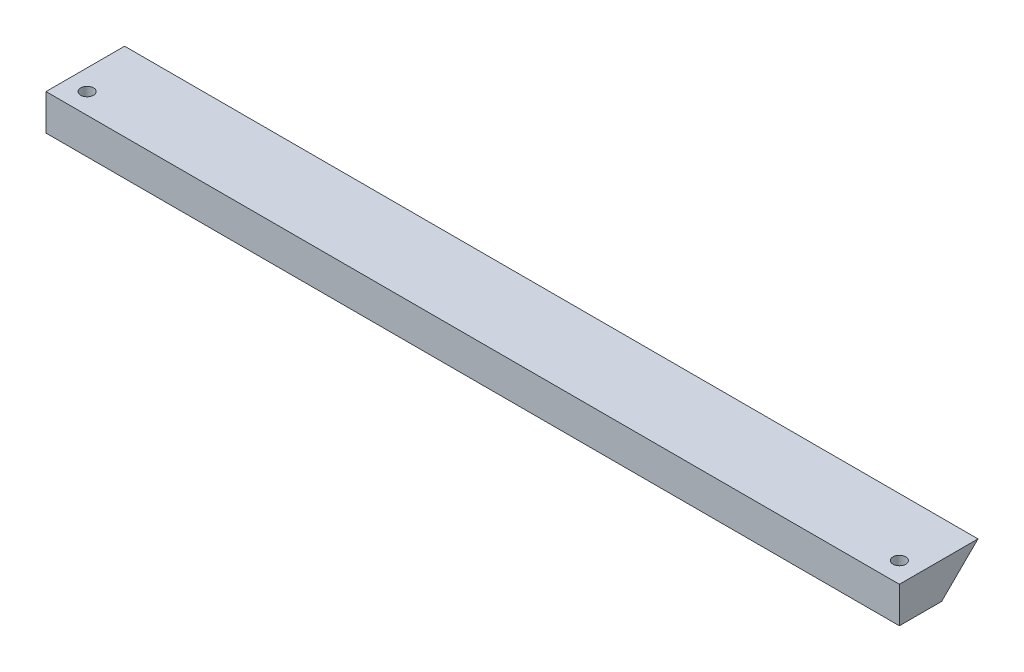
ISO-10303-21;
HEADER;
FILE_DESCRIPTION(('STEP AP214'),'2;1');
FILE_NAME('part.step','',(''),(''),'','','');
FILE_SCHEMA(('AUTOMOTIVE_DESIGN { 1 0 10303 214 1 1 1 1 }'));
ENDSEC;
DATA;
#1=APPLICATION_CONTEXT('core data for automotive mechanical design processes');
#2=APPLICATION_PROTOCOL_DEFINITION('international standard','automotive_design',2000,#1);
#3=PRODUCT_CONTEXT('',#1,'mechanical');
#4=PRODUCT('Part','Part','',(#3));
#5=PRODUCT_RELATED_PRODUCT_CATEGORY('part','',(#4));
#6=PRODUCT_DEFINITION_FORMATION('','',#4);
#7=PRODUCT_DEFINITION_CONTEXT('part definition',#1,'design');
#8=PRODUCT_DEFINITION('design','',#6,#7);
#9=PRODUCT_DEFINITION_SHAPE('','',#8);
#10=(LENGTH_UNIT() NAMED_UNIT(*) SI_UNIT(.MILLI.,.METRE.));
#11=(NAMED_UNIT(*) PLANE_ANGLE_UNIT() SI_UNIT($,.RADIAN.));
#12=(NAMED_UNIT(*) SI_UNIT($,.STERADIAN.) SOLID_ANGLE_UNIT());
#13=UNCERTAINTY_MEASURE_WITH_UNIT(LENGTH_MEASURE(1.E-05),#10,'distance_accuracy_value','');
#14=(GEOMETRIC_REPRESENTATION_CONTEXT(3) GLOBAL_UNCERTAINTY_ASSIGNED_CONTEXT((#13)) GLOBAL_UNIT_ASSIGNED_CONTEXT((#10,
#11,#12)) REPRESENTATION_CONTEXT('',''));
#15=CARTESIAN_POINT('',(0.,0.,0.));
#16=DIRECTION('',(0.,0.,1.));
#17=DIRECTION('',(1.,0.,0.));
#18=AXIS2_PLACEMENT_3D('',#15,#16,#17);
#19=CARTESIAN_POINT('',(83.,-7.,0.));
#20=DIRECTION('',(0.,0.,-1.));
#21=DIRECTION('',(-1.,0.,0.));
#22=AXIS2_PLACEMENT_3D('',#19,#20,#21);
#23=PLANE('',#22);
#24=DIRECTION('',(0.,-1.,0.));
#25=VECTOR('',#24,1.);
#26=CARTESIAN_POINT('',(-83.,-7.,0.));
#27=LINE('',#26,#25);
#28=CARTESIAN_POINT('',(-83.,0.,0.));
#29=VERTEX_POINT('',#28);
#30=CARTESIAN_POINT('',(-83.,-7.,0.));
#31=VERTEX_POINT('',#30);
#32=EDGE_CURVE('E98',#29,#31,#27,.T.);
#33=ORIENTED_EDGE('',*,*,#32,.T.);
#34=DIRECTION('',(-1.,0.,0.));
#35=VECTOR('',#34,1.);
#36=CARTESIAN_POINT('',(83.,-7.,0.));
#37=LINE('',#36,#35);
#38=CARTESIAN_POINT('',(83.,-7.,0.));
#39=VERTEX_POINT('',#38);
#40=EDGE_CURVE('E11',#39,#31,#37,.T.);
#41=ORIENTED_EDGE('',*,*,#40,.F.);
#42=DIRECTION('',(0.,-1.,0.));
#43=VECTOR('',#42,1.);
#44=CARTESIAN_POINT('',(83.,-7.,0.));
#45=LINE('',#44,#43);
#46=CARTESIAN_POINT('',(83.,0.,0.));
#47=VERTEX_POINT('',#46);
#48=EDGE_CURVE('E86',#47,#39,#45,.T.);
#49=ORIENTED_EDGE('',*,*,#48,.F.);
#50=DIRECTION('',(-1.,0.,0.));
#51=VECTOR('',#50,1.);
#52=CARTESIAN_POINT('',(83.,0.,0.));
#53=LINE('',#52,#51);
#54=EDGE_CURVE('E94',#47,#29,#53,.T.);
#55=ORIENTED_EDGE('',*,*,#54,.T.);
#56=EDGE_LOOP('',(#33,#41,#49,#55));
#57=FACE_BOUND('',#56,.T.);
#58=ADVANCED_FACE('F35',(#57),#23,.F.);
#59=CARTESIAN_POINT('',(83.,-7.,-8.22));
#60=DIRECTION('',(0.,1.,0.));
#61=DIRECTION('',(0.,0.,1.));
#62=AXIS2_PLACEMENT_3D('',#59,#60,#61);
#63=PLANE('',#62);
#64=CARTESIAN_POINT('',(-79.,-7.,-4.));
#65=DIRECTION('',(0.,-1.,0.));
#66=DIRECTION('',(0.,0.,-1.));
#67=AXIS2_PLACEMENT_3D('',#64,#65,#66);
#68=CIRCLE('',#67,1.24999999999999);
#69=CARTESIAN_POINT('',(-79.,-7.,-5.24999999999999));
#70=VERTEX_POINT('',#69);
#71=EDGE_CURVE('E120',#70,#70,#68,.T.);
#72=ORIENTED_EDGE('',*,*,#71,.F.);
#73=EDGE_LOOP('',(#72));
#74=FACE_BOUND('',#73,.T.);
#75=CARTESIAN_POINT('',(79.,-7.,-4.));
#76=DIRECTION('',(0.,-1.,0.));
#77=DIRECTION('',(0.,0.,-1.));
#78=AXIS2_PLACEMENT_3D('',#75,#76,#77);
#79=CIRCLE('',#78,1.24999999999999);
#80=CARTESIAN_POINT('',(79.,-7.,-5.24999999999999));
#81=VERTEX_POINT('',#80);
#82=EDGE_CURVE('E114',#81,#81,#79,.T.);
#83=ORIENTED_EDGE('',*,*,#82,.F.);
#84=EDGE_LOOP('',(#83));
#85=FACE_BOUND('',#84,.T.);
#86=DIRECTION('',(0.,0.,-1.));
#87=VECTOR('',#86,1.);
#88=CARTESIAN_POINT('',(-83.,-7.,-8.22));
#89=LINE('',#88,#87);
#90=CARTESIAN_POINT('',(-83.,-7.,-8.22));
#91=VERTEX_POINT('',#90);
#92=EDGE_CURVE('E90',#31,#91,#89,.T.);
#93=ORIENTED_EDGE('',*,*,#92,.T.);
#94=DIRECTION('',(-1.,0.,0.));
#95=VECTOR('',#94,1.);
#96=CARTESIAN_POINT('',(83.,-7.,-8.22));
#97=LINE('',#96,#95);
#98=CARTESIAN_POINT('',(83.,-7.,-8.22));
#99=VERTEX_POINT('',#98);
#100=EDGE_CURVE('E43',#99,#91,#97,.T.);
#101=ORIENTED_EDGE('',*,*,#100,.F.);
#102=DIRECTION('',(0.,0.,-1.));
#103=VECTOR('',#102,1.);
#104=CARTESIAN_POINT('',(83.,-7.,-8.22));
#105=LINE('',#104,#103);
#106=EDGE_CURVE('E81',#39,#99,#105,.T.);
#107=ORIENTED_EDGE('',*,*,#106,.F.);
#108=ORIENTED_EDGE('',*,*,#40,.T.);
#109=EDGE_LOOP('',(#93,#101,#107,#108));
#110=FACE_BOUND('',#109,.T.);
#111=ADVANCED_FACE('F89',(#74,#85,#110),#63,.F.);
#112=CARTESIAN_POINT('',(83.,0.,-15.29));
#113=DIRECTION('',(0.,0.710615930892041,0.703580129596081));
#114=DIRECTION('',(0.,-0.703580129596081,0.710615930892041));
#115=AXIS2_PLACEMENT_3D('',#112,#113,#114);
#116=PLANE('',#115);
#117=DIRECTION('',(0.,0.703580129596081,-0.710615930892041));
#118=VECTOR('',#117,1.);
#119=CARTESIAN_POINT('',(-83.,0.,-15.29));
#120=LINE('',#119,#118);
#121=CARTESIAN_POINT('',(-83.,0.,-15.29));
#122=VERTEX_POINT('',#121);
#123=EDGE_CURVE('E68',#91,#122,#120,.T.);
#124=ORIENTED_EDGE('',*,*,#123,.T.);
#125=DIRECTION('',(-1.,0.,0.));
#126=VECTOR('',#125,1.);
#127=CARTESIAN_POINT('',(83.,0.,-15.29));
#128=LINE('',#127,#126);
#129=CARTESIAN_POINT('',(83.,0.,-15.29));
#130=VERTEX_POINT('',#129);
#131=EDGE_CURVE('E91',#130,#122,#128,.T.);
#132=ORIENTED_EDGE('',*,*,#131,.F.);
#133=DIRECTION('',(0.,0.703580129596081,-0.710615930892041));
#134=VECTOR('',#133,1.);
#135=CARTESIAN_POINT('',(83.,0.,-15.29));
#136=LINE('',#135,#134);
#137=EDGE_CURVE('E84',#99,#130,#136,.T.);
#138=ORIENTED_EDGE('',*,*,#137,.F.);
#139=ORIENTED_EDGE('',*,*,#100,.T.);
#140=EDGE_LOOP('',(#124,#132,#138,#139));
#141=FACE_BOUND('',#140,.T.);
#142=ADVANCED_FACE('F92',(#141),#116,.F.);
#143=CARTESIAN_POINT('',(83.,0.,0.));
#144=DIRECTION('',(0.,-1.,0.));
#145=DIRECTION('',(0.,0.,-1.));
#146=AXIS2_PLACEMENT_3D('',#143,#144,#145);
#147=PLANE('',#146);
#148=CARTESIAN_POINT('',(-79.,0.,-4.));
#149=DIRECTION('',(0.,-1.,0.));
#150=DIRECTION('',(0.,0.,-1.));
#151=AXIS2_PLACEMENT_3D('',#148,#149,#150);
#152=CIRCLE('',#151,1.25);
#153=CARTESIAN_POINT('',(-79.,0.,-5.25));
#154=VERTEX_POINT('',#153);
#155=EDGE_CURVE('E117',#154,#154,#152,.T.);
#156=ORIENTED_EDGE('',*,*,#155,.T.);
#157=EDGE_LOOP('',(#156));
#158=FACE_BOUND('',#157,.T.);
#159=CARTESIAN_POINT('',(79.,0.,-4.));
#160=DIRECTION('',(0.,-1.,0.));
#161=DIRECTION('',(0.,0.,-1.));
#162=AXIS2_PLACEMENT_3D('',#159,#160,#161);
#163=CIRCLE('',#162,1.25);
#164=CARTESIAN_POINT('',(79.,0.,-5.25));
#165=VERTEX_POINT('',#164);
#166=EDGE_CURVE('E101',#165,#165,#163,.T.);
#167=ORIENTED_EDGE('',*,*,#166,.T.);
#168=EDGE_LOOP('',(#167));
#169=FACE_BOUND('',#168,.T.);
#170=DIRECTION('',(0.,0.,1.));
#171=VECTOR('',#170,1.);
#172=CARTESIAN_POINT('',(-83.,0.,0.));
#173=LINE('',#172,#171);
#174=EDGE_CURVE('E74',#122,#29,#173,.T.);
#175=ORIENTED_EDGE('',*,*,#174,.T.);
#176=ORIENTED_EDGE('',*,*,#54,.F.);
#177=DIRECTION('',(0.,0.,1.));
#178=VECTOR('',#177,1.);
#179=CARTESIAN_POINT('',(83.,0.,0.));
#180=LINE('',#179,#178);
#181=EDGE_CURVE('E51',#130,#47,#180,.T.);
#182=ORIENTED_EDGE('',*,*,#181,.F.);
#183=ORIENTED_EDGE('',*,*,#131,.T.);
#184=EDGE_LOOP('',(#175,#176,#182,#183));
#185=FACE_BOUND('',#184,.T.);
#186=ADVANCED_FACE('F106',(#158,#169,#185),#147,.F.);
#187=CARTESIAN_POINT('',(83.,0.,0.));
#188=DIRECTION('',(-1.,0.,0.));
#189=DIRECTION('',(0.,0.,1.));
#190=AXIS2_PLACEMENT_3D('',#187,#188,#189);
#191=PLANE('',#190);
#192=ORIENTED_EDGE('',*,*,#48,.T.);
#193=ORIENTED_EDGE('',*,*,#106,.T.);
#194=ORIENTED_EDGE('',*,*,#137,.T.);
#195=ORIENTED_EDGE('',*,*,#181,.T.);
#196=EDGE_LOOP('',(#192,#193,#194,#195));
#197=FACE_BOUND('',#196,.T.);
#198=ADVANCED_FACE('F82',(#197),#191,.F.);
#199=CARTESIAN_POINT('',(-83.,0.,0.));
#200=DIRECTION('',(-1.,0.,0.));
#201=DIRECTION('',(0.,0.,1.));
#202=AXIS2_PLACEMENT_3D('',#199,#200,#201);
#203=PLANE('',#202);
#204=ORIENTED_EDGE('',*,*,#32,.F.);
#205=ORIENTED_EDGE('',*,*,#174,.F.);
#206=ORIENTED_EDGE('',*,*,#123,.F.);
#207=ORIENTED_EDGE('',*,*,#92,.F.);
#208=EDGE_LOOP('',(#204,#205,#206,#207));
#209=FACE_BOUND('',#208,.T.);
#210=ADVANCED_FACE('F109',(#209),#203,.T.);
#211=CARTESIAN_POINT('',(79.,-7.,-4.));
#212=DIRECTION('',(0.,-1.,0.));
#213=DIRECTION('',(0.,0.,-1.));
#214=AXIS2_PLACEMENT_3D('',#211,#212,#213);
#215=CYLINDRICAL_SURFACE('',#214,1.24999999999999);
#216=ORIENTED_EDGE('',*,*,#166,.F.);
#217=EDGE_LOOP('',(#216));
#218=FACE_BOUND('',#217,.T.);
#219=ORIENTED_EDGE('',*,*,#82,.T.);
#220=EDGE_LOOP('',(#219));
#221=FACE_BOUND('',#220,.T.);
#222=ADVANCED_FACE('F130',(#218,#221),#215,.F.);
#223=CARTESIAN_POINT('',(-79.,-7.,-4.));
#224=DIRECTION('',(0.,-1.,0.));
#225=DIRECTION('',(0.,0.,-1.));
#226=AXIS2_PLACEMENT_3D('',#223,#224,#225);
#227=CYLINDRICAL_SURFACE('',#226,1.24999999999999);
#228=ORIENTED_EDGE('',*,*,#155,.F.);
#229=EDGE_LOOP('',(#228));
#230=FACE_BOUND('',#229,.T.);
#231=ORIENTED_EDGE('',*,*,#71,.T.);
#232=EDGE_LOOP('',(#231));
#233=FACE_BOUND('',#232,.T.);
#234=ADVANCED_FACE('F124',(#230,#233),#227,.F.);
#235=CLOSED_SHELL('',(#58,#111,#142,#186,#198,#210,#222,#234));
#236=MANIFOLD_SOLID_BREP('B2',#235);
#237=ADVANCED_BREP_SHAPE_REPRESENTATION('',(#18,#236),#14);
#238=SHAPE_DEFINITION_REPRESENTATION(#9,#237);
ENDSEC;
END-ISO-10303-21;
